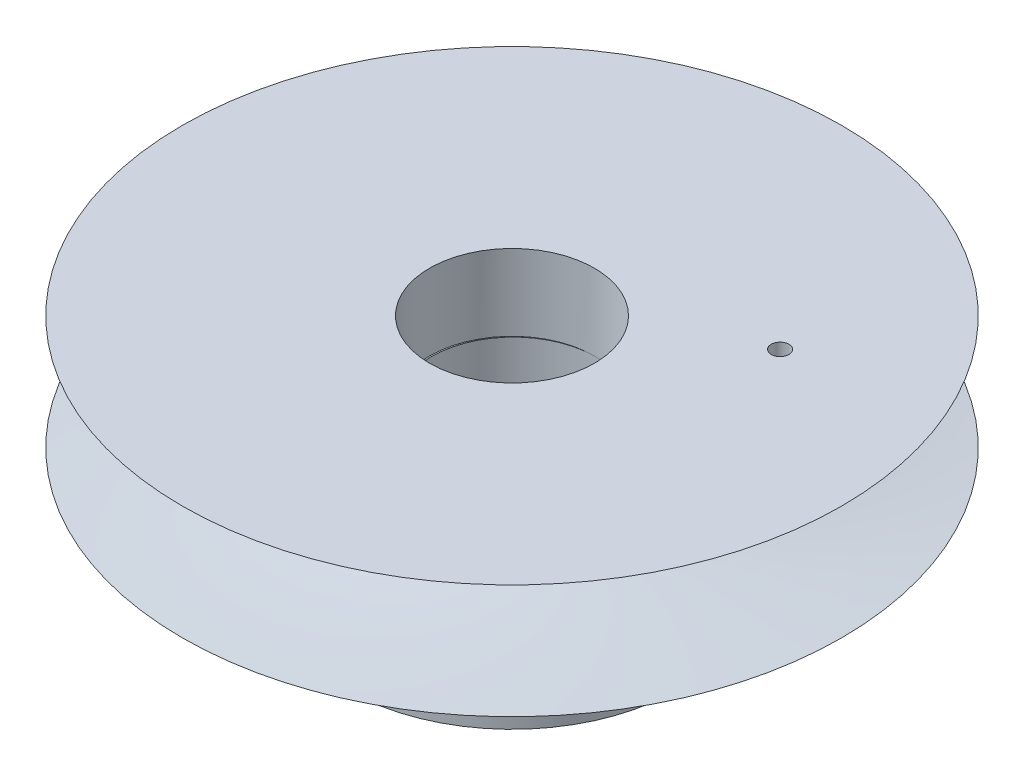
ISO-10303-21;
HEADER;
FILE_DESCRIPTION(('STEP AP214'),'2;1');
FILE_NAME('part.step','',(''),(''),'','','');
FILE_SCHEMA(('AUTOMOTIVE_DESIGN { 1 0 10303 214 1 1 1 1 }'));
ENDSEC;
DATA;
#1=APPLICATION_CONTEXT('core data for automotive mechanical design processes');
#2=APPLICATION_PROTOCOL_DEFINITION('international standard','automotive_design',2000,#1);
#3=PRODUCT_CONTEXT('',#1,'mechanical');
#4=PRODUCT('Part','Part','',(#3));
#5=PRODUCT_RELATED_PRODUCT_CATEGORY('part','',(#4));
#6=PRODUCT_DEFINITION_FORMATION('','',#4);
#7=PRODUCT_DEFINITION_CONTEXT('part definition',#1,'design');
#8=PRODUCT_DEFINITION('design','',#6,#7);
#9=PRODUCT_DEFINITION_SHAPE('','',#8);
#10=(LENGTH_UNIT() NAMED_UNIT(*) SI_UNIT(.MILLI.,.METRE.));
#11=(NAMED_UNIT(*) PLANE_ANGLE_UNIT() SI_UNIT($,.RADIAN.));
#12=(NAMED_UNIT(*) SI_UNIT($,.STERADIAN.) SOLID_ANGLE_UNIT());
#13=UNCERTAINTY_MEASURE_WITH_UNIT(LENGTH_MEASURE(1.E-05),#10,'distance_accuracy_value','');
#14=(GEOMETRIC_REPRESENTATION_CONTEXT(3) GLOBAL_UNCERTAINTY_ASSIGNED_CONTEXT((#13)) GLOBAL_UNIT_ASSIGNED_CONTEXT((#10,
#11,#12)) REPRESENTATION_CONTEXT('',''));
#15=CARTESIAN_POINT('',(0.,0.,0.));
#16=DIRECTION('',(0.,0.,1.));
#17=DIRECTION('',(1.,0.,0.));
#18=AXIS2_PLACEMENT_3D('',#15,#16,#17);
#19=CARTESIAN_POINT('',(1.81538548412725,-5.43164949076936,-0.870852952540729));
#20=DIRECTION('',(-0.991094193323921,0.,-0.133162682308544));
#21=DIRECTION('',(-0.133162682308544,0.,0.991094193323921));
#22=AXIS2_PLACEMENT_3D('',#19,#20,#21);
#23=CYLINDRICAL_SURFACE('',#22,0.799999999999998);
#24=CARTESIAN_POINT('',(11.3629547996772,-5.43164949076936,1.2191400607756));
#25=CARTESIAN_POINT('',(11.362955824008,-5.38746564802559,1.21913889182571));
#26=CARTESIAN_POINT('',(11.3643840639199,-5.34326734263764,1.21562619161921));
#27=CARTESIAN_POINT('',(11.369970894691,-5.25613884409695,1.2016793800079));
#28=CARTESIAN_POINT('',(11.3741311256032,-5.21320942886404,1.19124111104665));
#29=CARTESIAN_POINT('',(11.3848089209207,-5.12989205809428,1.16377040137494));
#30=CARTESIAN_POINT('',(11.3913234633044,-5.08950092206456,1.14674641220722));
#31=CARTESIAN_POINT('',(11.4061722618849,-5.0122643975639,1.10656738660333));
#32=CARTESIAN_POINT('',(11.4145065835889,-4.97541913680366,1.08341212945177));
#33=CARTESIAN_POINT('',(11.4325288938561,-4.90552094307044,1.03103534442441));
#34=CARTESIAN_POINT('',(11.4422401607888,-4.87255623032236,1.00170407305786));
#35=CARTESIAN_POINT('',(11.4621652187059,-4.81213111086203,0.937974165068692));
#36=CARTESIAN_POINT('',(11.4723790569402,-4.78467122292829,0.903575051378586));
#37=CARTESIAN_POINT('',(11.492737323863,-4.73566767542198,0.830029058301897));
#38=CARTESIAN_POINT('',(11.5028787807879,-4.71421218977338,0.7908224724703));
#39=CARTESIAN_POINT('',(11.5222623633533,-4.67839788278787,0.709085347735116));
#40=CARTESIAN_POINT('',(11.531504616409,-4.66403805483182,0.666555281306145));
#41=CARTESIAN_POINT('',(11.5483649250624,-4.64310098300448,0.58022501484586));
#42=CARTESIAN_POINT('',(11.5560112418189,-4.63637684628741,0.536465995181015));
#43=CARTESIAN_POINT('',(11.569541500734,-4.63044321098203,0.448175650759507));
#44=CARTESIAN_POINT('',(11.5754257001312,-4.63123261499493,0.403644439734472));
#45=CARTESIAN_POINT('',(11.5851656130302,-4.64019746461082,0.316110729919203));
#46=CARTESIAN_POINT('',(11.5890629224037,-4.64821080180553,0.273096108552672));
#47=CARTESIAN_POINT('',(11.5950675351164,-4.67113767105418,0.188818926166639));
#48=CARTESIAN_POINT('',(11.5971747492606,-4.6860515468835,0.147556452548566));
#49=CARTESIAN_POINT('',(11.5998276739148,-4.72247823140479,0.0675887516157881));
#50=CARTESIAN_POINT('',(11.6003601982022,-4.74404510432438,0.028907755749405));
#51=CARTESIAN_POINT('',(11.600185118838,-4.79312473062051,-0.0444765050439377));
#52=CARTESIAN_POINT('',(11.599477307341,-4.82063847984959,-0.0791791022645083));
#53=CARTESIAN_POINT('',(11.5972362686096,-4.88167930416778,-0.144519330407231));
#54=CARTESIAN_POINT('',(11.5956819969905,-4.91534448689723,-0.175027351129087));
#55=CARTESIAN_POINT('',(11.592251270701,-4.98728880544946,-0.229990541318215));
#56=CARTESIAN_POINT('',(11.5903748014738,-5.02556814971409,-0.25444543718688));
#57=CARTESIAN_POINT('',(11.586785904301,-5.10591898450074,-0.296639539025105));
#58=CARTESIAN_POINT('',(11.58507432067,-5.14800805233976,-0.31434542413599));
#59=CARTESIAN_POINT('',(11.5822416762154,-5.23462289785417,-0.342250437202742));
#60=CARTESIAN_POINT('',(11.5811204959108,-5.27914818049339,-0.352451084173401));
#61=CARTESIAN_POINT('',(11.5797484146886,-5.36817386306984,-0.364807571468669));
#62=CARTESIAN_POINT('',(11.5794763729141,-5.41264682750206,-0.367158939535269));
#63=CARTESIAN_POINT('',(11.5798026220255,-5.50134025625504,-0.364278093267064));
#64=CARTESIAN_POINT('',(11.5804008365899,-5.54556074237676,-0.359046543955736));
#65=CARTESIAN_POINT('',(11.5823194797323,-5.63178528209781,-0.341335725932225));
#66=CARTESIAN_POINT('',(11.5836285481024,-5.67381309169658,-0.328970275515855));
#67=CARTESIAN_POINT('',(11.5866752490524,-5.75524738030465,-0.297501166973181));
#68=CARTESIAN_POINT('',(11.5884129307249,-5.79465355838012,-0.278396736868558));
#69=CARTESIAN_POINT('',(11.5919529903819,-5.87054217262511,-0.233625406771424));
#70=CARTESIAN_POINT('',(11.5937559705032,-5.906955804007,-0.207842003081071));
#71=CARTESIAN_POINT('',(11.5969143735172,-5.97508925086132,-0.150653674383652));
#72=CARTESIAN_POINT('',(11.5982697263624,-6.00680833127129,-0.119247870731022));
#73=CARTESIAN_POINT('',(11.6000674715202,-6.065421196526,-0.0508800434021028));
#74=CARTESIAN_POINT('',(11.6004875098317,-6.09218309341535,-0.0138041627424656));
#75=CARTESIAN_POINT('',(11.5998804974145,-6.13916526549856,0.0642756884873532));
#76=CARTESIAN_POINT('',(11.5988535249484,-6.15938589440895,0.105279446503634));
#77=CARTESIAN_POINT('',(11.5950134077946,-6.19253436078745,0.189706413809033));
#78=CARTESIAN_POINT('',(11.592213757645,-6.2055159138138,0.233109102550756));
#79=CARTESIAN_POINT('',(11.5846619788343,-6.22398400963894,0.321314743919787));
#80=CARTESIAN_POINT('',(11.5799102120255,-6.2294719406713,0.36611743561554));
#81=CARTESIAN_POINT('',(11.5686333443281,-6.2327227601291,0.454589872658844));
#82=CARTESIAN_POINT('',(11.562157586142,-6.23068287753606,0.498258773875086));
#83=CARTESIAN_POINT('',(11.5476105302422,-6.21938835102713,0.584377872588568));
#84=CARTESIAN_POINT('',(11.5395392732158,-6.21013389107462,0.626828101131936));
#85=CARTESIAN_POINT('',(11.5222473655215,-6.18477333531236,0.709153215888572));
#86=CARTESIAN_POINT('',(11.5130321729211,-6.16869895324306,0.749039050552911));
#87=CARTESIAN_POINT('',(11.4939580501648,-6.13018681158355,0.825441122442783));
#88=CARTESIAN_POINT('',(11.4840990398487,-6.10774825843779,0.861956938703935));
#89=CARTESIAN_POINT('',(11.4641264905033,-6.0565235958915,0.931566330053697));
#90=CARTESIAN_POINT('',(11.4540124487805,-6.02759985371037,0.964558483191727));
#91=CARTESIAN_POINT('',(11.4344744895567,-5.964494248948,1.0253182066733));
#92=CARTESIAN_POINT('',(11.4250507467067,-5.93031106242302,1.05308445759302));
#93=CARTESIAN_POINT('',(11.4074502335692,-5.85692114948477,1.10315038380213));
#94=CARTESIAN_POINT('',(11.3992987219608,-5.81763565017607,1.12534364354321));
#95=CARTESIAN_POINT('',(11.3851405735877,-5.73561974131288,1.16298783019119));
#96=CARTESIAN_POINT('',(11.3791323324154,-5.69289193809235,1.17844380242324));
#97=CARTESIAN_POINT('',(11.3707055015352,-5.61379235935702,1.19985233005622));
#98=CARTESIAN_POINT('',(11.3678151539306,-5.5778078649709,1.20707100552066));
#99=CARTESIAN_POINT('',(11.3639394544073,-5.50510203575396,1.21671516256877));
#100=CARTESIAN_POINT('',(11.3629539481223,-5.46838076087473,1.21914103255649));
#101=CARTESIAN_POINT('',(11.3629547996772,-5.43164949076936,1.2191400607756));
#102=B_SPLINE_CURVE_WITH_KNOTS('',3,(#24,#25,#26,#27,#28,#29,#30,#31,#32,#33,#34,#35,#36,#37,
#38,#39,#40,#41,#42,#43,#44,#45,#46,#47,#48,#49,#50,#51,#52,#53,#54,#55,#56,#57,#58,#59,#60,#61,
#62,#63,#64,#65,#66,#67,#68,#69,#70,#71,#72,#73,#74,#75,#76,#77,#78,#79,#80,#81,#82,#83,#84,#85,
#86,#87,#88,#89,#90,#91,#92,#93,#94,#95,#96,#97,#98,#99,#100,#101),.UNSPECIFIED.,.T.,.F.,(4,2,2,
2,2,2,2,2,2,2,2,2,2,2,2,2,2,2,2,2,2,2,2,2,2,2,2,2,2,2,2,2,2,2,2,2,2,2,4),(0.,0.132416623177268,
0.264912810695005,0.39723952514844,0.529571003790153,0.66448950887155,0.799420722795304,
0.936240258965104,1.073040379777,1.2071616687229,1.34126336873116,1.4724286844168,
1.60360053528276,1.73586773247498,1.8681570960633,2.00389639374017,2.13964182565426,
2.2760490299111,2.41242861857493,2.54538454356824,2.67832880900398,2.80920845961829,
2.94010310791573,3.07345592241951,3.20682959497394,3.34335815620517,3.47987933347305,
3.61537353448868,3.75084263107127,3.88278793392237,4.01472987243075,4.14606487058248,
4.27741625224572,4.41187567108434,4.54636899252238,4.68326281608587,4.82005394766897,
4.9301445296165,5.04022618957013),.UNSPECIFIED.);
#103=CARTESIAN_POINT('',(11.3629547996772,-5.43164949076936,1.2191400607756));
#104=VERTEX_POINT('',#103);
#105=EDGE_CURVE('E43',#104,#104,#102,.T.);
#106=ORIENTED_EDGE('',*,*,#105,.T.);
#107=EDGE_LOOP('',(#106));
#108=FACE_BOUND('',#107,.T.);
#109=CARTESIAN_POINT('',(14.6232276632152,-5.43164949076936,1.65718790980036));
#110=CARTESIAN_POINT('',(14.6232285423907,-5.38689388208723,1.65718610338816));
#111=CARTESIAN_POINT('',(14.6241932172446,-5.34211011048688,1.65351536227793));
#112=CARTESIAN_POINT('',(14.6279879225404,-5.25378835530042,1.63892462455044));
#113=CARTESIAN_POINT('',(14.6308199146819,-5.21025173214282,1.62799700417297));
#114=CARTESIAN_POINT('',(14.6381507130368,-5.1257158485961,1.59920370558382));
#115=CARTESIAN_POINT('',(14.642648402077,-5.08471490899901,1.58134267718221));
#116=CARTESIAN_POINT('',(14.6530073040293,-5.0063739620068,1.53917613265695));
#117=CARTESIAN_POINT('',(14.6588682794177,-4.96903331849192,1.51487173904977));
#118=CARTESIAN_POINT('',(14.6716068562294,-4.89886477627407,1.46033985308055));
#119=CARTESIAN_POINT('',(14.6784891935206,-4.86605935393636,1.43008454254686));
#120=CARTESIAN_POINT('',(14.6928249730675,-4.80608656379418,1.36453726206844));
#121=CARTESIAN_POINT('',(14.7002784434357,-4.77891947376611,1.32924504412141));
#122=CARTESIAN_POINT('',(14.7153491757765,-4.73091419341167,1.2544572869117));
#123=CARTESIAN_POINT('',(14.72296688137,-4.71009629970239,1.21494880164004));
#124=CARTESIAN_POINT('',(14.7379360486431,-4.67551033759991,1.13291094451407));
#125=CARTESIAN_POINT('',(14.7452875197957,-4.66174201814593,1.09038168030203));
#126=CARTESIAN_POINT('',(14.7593425038368,-4.64171306797088,1.00371794896085));
#127=CARTESIAN_POINT('',(14.7660490831124,-4.63541510978355,0.959592607799138));
#128=CARTESIAN_POINT('',(14.7785994402972,-4.63038999645085,0.870792422805709));
#129=CARTESIAN_POINT('',(14.7844432507854,-4.63166255535966,0.826117599792069));
#130=CARTESIAN_POINT('',(14.7950849286729,-4.64171239317647,0.737740465696337));
#131=CARTESIAN_POINT('',(14.7998882190077,-4.65044952818574,0.694034233195488));
#132=CARTESIAN_POINT('',(14.8084401951434,-4.67511777493138,0.608593787501458));
#133=CARTESIAN_POINT('',(14.8121888616132,-4.69104901852023,0.566859610467281));
#134=CARTESIAN_POINT('',(14.818686810666,-4.72969609794835,0.486444010430453));
#135=CARTESIAN_POINT('',(14.8214334868195,-4.75242935216511,0.44777075117003));
#136=CARTESIAN_POINT('',(14.8260382059198,-4.8040224711038,0.374693012350333));
#137=CARTESIAN_POINT('',(14.8278962098182,-4.83288260496094,0.340288720419042));
#138=CARTESIAN_POINT('',(14.830908169946,-4.89613519918013,0.276519536058027));
#139=CARTESIAN_POINT('',(14.8320574378078,-4.93056263788654,0.247189106186187));
#140=CARTESIAN_POINT('',(14.8338320988496,-5.00385228459629,0.194701435202917));
#141=CARTESIAN_POINT('',(14.8344574905101,-5.04271450546203,0.171544211996561));
#142=CARTESIAN_POINT('',(14.835374044976,-5.12380105148705,0.132086417340071));
#143=CARTESIAN_POINT('',(14.8356650753751,-5.16602670148361,0.115788563802393));
#144=CARTESIAN_POINT('',(14.8360633118534,-5.25262571324516,0.0905641895641914));
#145=CARTESIAN_POINT('',(14.8361705264048,-5.29699897592803,0.0816373291385821));
#146=CARTESIAN_POINT('',(14.8362896290041,-5.38632666118881,0.0714669594083169));
#147=CARTESIAN_POINT('',(14.8363021284823,-5.43127547653657,0.0701741805181361));
#148=CARTESIAN_POINT('',(14.8362464508406,-5.52074740301057,0.0751805424654309));
#149=CARTESIAN_POINT('',(14.8361782753658,-5.56527052279879,0.0814795284940992));
#150=CARTESIAN_POINT('',(14.8358988536232,-5.65248110194662,0.10144044943636));
#151=CARTESIAN_POINT('',(14.8356880686569,-5.69517400949202,0.115078615158611));
#152=CARTESIAN_POINT('',(14.8349962093295,-5.77768258333974,0.149288353446227));
#153=CARTESIAN_POINT('',(14.8345151258527,-5.81749815255307,0.169860159838414));
#154=CARTESIAN_POINT('',(14.8331054192907,-5.89334332008084,0.217449179952169));
#155=CARTESIAN_POINT('',(14.8321745429946,-5.9293527327057,0.244498494502588));
#156=CARTESIAN_POINT('',(14.8296675182739,-5.99635760013778,0.304198701990065));
#157=CARTESIAN_POINT('',(14.8280913458281,-6.02735286823351,0.336849803427388));
#158=CARTESIAN_POINT('',(14.8240954174176,-6.08362105686695,0.407009497784259));
#159=CARTESIAN_POINT('',(14.8216711099469,-6.10886186416613,0.444543598526803));
#160=CARTESIAN_POINT('',(14.8158312504636,-6.15268257787918,0.523247496623109));
#161=CARTESIAN_POINT('',(14.8124157177072,-6.17126261367381,0.564417223338058));
#162=CARTESIAN_POINT('',(14.804524556844,-6.20118117293371,0.649093133566165));
#163=CARTESIAN_POINT('',(14.8000517012225,-6.21253835331013,0.692592980196058));
#164=CARTESIAN_POINT('',(14.7900553801637,-6.22774953022037,0.780767484098668));
#165=CARTESIAN_POINT('',(14.7845319600101,-6.2316038500773,0.825442090662999));
#166=CARTESIAN_POINT('',(14.7725932641062,-6.23169403092554,0.914381634596473));
#167=CARTESIAN_POINT('',(14.7661840440878,-6.22797944776823,0.958647342789999));
#168=CARTESIAN_POINT('',(14.7526669105414,-6.21314210098296,1.04580857745071));
#169=CARTESIAN_POINT('',(14.7455589973586,-6.20201934101534,1.08870410459488));
#170=CARTESIAN_POINT('',(14.7309572839263,-6.17269672960967,1.17191640578135));
#171=CARTESIAN_POINT('',(14.723463608032,-6.15449914658373,1.21223400156988));
#172=CARTESIAN_POINT('',(14.7084659455005,-6.11154858667805,1.2892078841463));
#173=CARTESIAN_POINT('',(14.7009619587625,-6.08679554525455,1.32586413488042));
#174=CARTESIAN_POINT('',(14.6863141325435,-6.03125302080083,1.39475152648839));
#175=CARTESIAN_POINT('',(14.6791728472817,-6.00042664862577,1.4269534691128));
#176=CARTESIAN_POINT('',(14.6657308394642,-5.9336888633646,1.48580002728916));
#177=CARTESIAN_POINT('',(14.6594303166723,-5.89777624595848,1.51244332296023));
#178=CARTESIAN_POINT('',(14.6480534605966,-5.82173354753015,1.55953020684399));
#179=CARTESIAN_POINT('',(14.6429817445171,-5.78158834903103,1.57995048409934));
#180=CARTESIAN_POINT('',(14.6344397952977,-5.69835031402823,1.61387478872132));
#181=CARTESIAN_POINT('',(14.6309678131482,-5.65526075612353,1.62738637123598));
#182=CARTESIAN_POINT('',(14.626702664487,-5.58189625962208,1.64387832601437));
#183=CARTESIAN_POINT('',(14.6254035894691,-5.55208487697699,1.64886257883413));
#184=CARTESIAN_POINT('',(14.6236657951211,-5.49206977036485,1.65551796868654));
#185=CARTESIAN_POINT('',(14.6232270696436,-5.46186604920267,1.65718912939186));
#186=CARTESIAN_POINT('',(14.6232276632152,-5.43164949076936,1.65718790980036));
#187=B_SPLINE_CURVE_WITH_KNOTS('',3,(#109,#110,#111,#112,#113,#114,#115,#116,#117,#118,#119,
#120,#121,#122,#123,#124,#125,#126,#127,#128,#129,#130,#131,#132,#133,#134,#135,#136,#137,#138,
#139,#140,#141,#142,#143,#144,#145,#146,#147,#148,#149,#150,#151,#152,#153,#154,#155,#156,#157,
#158,#159,#160,#161,#162,#163,#164,#165,#166,#167,#168,#169,#170,#171,#172,#173,#174,#175,#176,
#177,#178,#179,#180,#181,#182,#183,#184,#185,#186),.UNSPECIFIED.,.T.,.F.,(4,2,2,2,2,2,2,2,2,2,2,
2,2,2,2,2,2,2,2,2,2,2,2,2,2,2,2,2,2,2,2,2,2,2,2,2,2,2,4),(0.,0.134156444816222,
0.268454051962342,0.402661749135058,0.536846080960288,0.671673254094057,0.806507068006988,
0.941767496346315,1.07702310723883,1.21159999492362,1.34617179953998,1.48002441067543,
1.6138794751396,1.74808028857725,1.8822869982689,2.01737223537042,2.15245786427561,
2.28759696836332,2.42272984361512,2.55698962354853,2.69124666574639,2.82507148757523,
2.95890082290074,3.09340763033806,3.22791944524748,3.36316447844813,3.49840688446776,
3.63329851994902,3.76818434237438,3.90218986536058,4.0361953221355,4.17015784790922,
4.3041216927006,4.43892581295428,4.57376190562698,4.70909704556757,4.84428386868606,
4.93485966775244,5.02543481963532),.UNSPECIFIED.);
#188=CARTESIAN_POINT('',(14.6232276632152,-5.43164949076936,1.65718790980036));
#189=VERTEX_POINT('',#188);
#190=EDGE_CURVE('E103',#189,#189,#187,.T.);
#191=ORIENTED_EDGE('',*,*,#190,.F.);
#192=EDGE_LOOP('',(#191));
#193=FACE_BOUND('',#192,.T.);
#194=ADVANCED_FACE('F37',(#108,#193),#23,.F.);
#195=CARTESIAN_POINT('',(-4.7030891410279,1.56463653790778,0.));
#196=CARTESIAN_POINT('',(8.2969108589721,-1.43536346209222,0.));
#197=CARTESIAN_POINT('',(-4.7030891410279,-2.93536346209222,0.));
#198=B_SPLINE_CURVE_WITH_KNOTS('',2,(#195,#196,#197),.UNSPECIFIED.,.F.,.F.,(3,3),(0.,1.),.UNSPECIFIED.);
#199=CARTESIAN_POINT('',(8.2969108589721,-2.93536346209222,0.));
#200=DIRECTION('',(0.,-1.,0.));
#201=AXIS1_PLACEMENT('',#199,#200);
#202=SURFACE_OF_REVOLUTION('',#198,#201);
#203=CARTESIAN_POINT('',(14.7306842350758,-0.137545685161674,-3.78665927067086));
#204=CARTESIAN_POINT('',(14.7524880423904,-0.128022776899245,-3.78665945360138));
#205=CARTESIAN_POINT('',(14.774142958328,-0.118153199409983,-3.78869845889688));
#206=CARTESIAN_POINT('',(14.816601616338,-0.0980627513688897,-3.79667980399076));
#207=CARTESIAN_POINT('',(14.8374033799984,-0.0878411554093741,-3.80263072545225));
#208=CARTESIAN_POINT('',(14.8775063595165,-0.067397353666468,-3.81821802500021));
#209=CARTESIAN_POINT('',(14.8968110687977,-0.0571752086468087,-3.8278454920844));
#210=CARTESIAN_POINT('',(14.9334516556567,-0.0369658054808928,-3.85056378734687));
#211=CARTESIAN_POINT('',(14.9507846650859,-0.0269789058545795,-3.8636595709227));
#212=CARTESIAN_POINT('',(14.9829633859423,-0.00746905334614902,-3.89307641023971));
#213=CARTESIAN_POINT('',(14.9977968004458,0.00205145123808069,-3.90941259712734));
#214=CARTESIAN_POINT('',(15.0242850530844,0.0203111866631368,-3.94485880790843));
#215=CARTESIAN_POINT('',(15.0359418954949,0.0290509077924598,-3.96396707102678));
#216=CARTESIAN_POINT('',(15.054999301863,0.0450545932673463,-4.0033455946064));
#217=CARTESIAN_POINT('',(15.0625930984939,0.05237229438464,-4.02350017781848));
#218=CARTESIAN_POINT('',(15.0739863227207,0.0658419780057974,-4.06518311011768));
#219=CARTESIAN_POINT('',(15.0777945165633,0.0719966268495735,-4.08670816195498));
#220=CARTESIAN_POINT('',(15.0811716802236,0.0824992358114472,-4.12863985472954));
#221=CARTESIAN_POINT('',(15.0810620153768,0.0869538181606614,-4.14899390031347));
#222=CARTESIAN_POINT('',(15.0772555669366,0.0945742941696207,-4.18960814368091));
#223=CARTESIAN_POINT('',(15.073560679129,0.0977408676438877,-4.2098683853771));
#224=CARTESIAN_POINT('',(15.0630195228015,0.102490049271375,-4.24808885242244));
#225=CARTESIAN_POINT('',(15.0564301484846,0.104173570078617,-4.26610766353498));
#226=CARTESIAN_POINT('',(15.0403571179217,0.106290322580797,-4.30088238401837));
#227=CARTESIAN_POINT('',(15.0308743230058,0.106723925957555,-4.31763866737723));
#228=CARTESIAN_POINT('',(15.0097568003996,0.106335772973921,-4.34868803424499));
#229=CARTESIAN_POINT('',(14.9982297222422,0.105566200233738,-4.36305520698049));
#230=CARTESIAN_POINT('',(14.9731136565103,0.102889667586205,-4.38976890583614));
#231=CARTESIAN_POINT('',(14.9595219625367,0.100981205006542,-4.40211273484241));
#232=CARTESIAN_POINT('',(14.930706593256,0.0960815880337972,-4.42444989994798));
#233=CARTESIAN_POINT('',(14.9154830009916,0.0930904887147387,-4.43444335556876));
#234=CARTESIAN_POINT('',(14.8838328782062,0.0861030094763409,-4.45189357851671));
#235=CARTESIAN_POINT('',(14.867404568006,0.082105120165258,-4.45934649719818));
#236=CARTESIAN_POINT('',(14.8331631661637,0.0730326218470007,-4.47183540432064));
#237=CARTESIAN_POINT('',(14.8153210384709,0.0679219721490656,-4.47676528864877));
#238=CARTESIAN_POINT('',(14.7793170399134,0.0568451682841831,-4.48374988625452));
#239=CARTESIAN_POINT('',(14.7611546923653,0.0508776238948765,-4.48579986774959));
#240=CARTESIAN_POINT('',(14.7237726655056,0.0378013486522078,-4.48712315649504));
#241=CARTESIAN_POINT('',(14.7045635424498,0.0306429797857098,-4.48620152006191));
#242=CARTESIAN_POINT('',(14.6667774230858,0.015663247122014,-4.48130363186169));
#243=CARTESIAN_POINT('',(14.6482015123378,0.00784081783585622,-4.47732238526506));
#244=CARTESIAN_POINT('',(14.6107190832189,-0.00892562069059466,-4.46608345856086));
#245=CARTESIAN_POINT('',(14.5918996911812,-0.0179095254228833,-4.4585945441988));
#246=CARTESIAN_POINT('',(14.555960040902,-0.0362448437252807,-4.44059320993032));
#247=CARTESIAN_POINT('',(14.5388405391772,-0.0455964183611732,-4.43007945189225));
#248=CARTESIAN_POINT('',(14.5056275306196,-0.0650817284906285,-4.40555198500114));
#249=CARTESIAN_POINT('',(14.4896771703984,-0.0752262325171255,-4.39135252699894));
#250=CARTESIAN_POINT('',(14.4606031850977,-0.0954047144767724,-4.36028488229922));
#251=CARTESIAN_POINT('',(14.4474758661298,-0.105438820339455,-4.34342023372563));
#252=CARTESIAN_POINT('',(14.4241600525154,-0.125325819386845,-4.30701333336033));
#253=CARTESIAN_POINT('',(14.4140435972642,-0.13516968603367,-4.28741977100869));
#254=CARTESIAN_POINT('',(14.3975743117474,-0.154057646321508,-4.24632958316782));
#255=CARTESIAN_POINT('',(14.3912227693818,-0.163101465383559,-4.22483230934481));
#256=CARTESIAN_POINT('',(14.3829321895648,-0.179489426062024,-4.18167378806571));
#257=CARTESIAN_POINT('',(14.3807834450021,-0.186896973098744,-4.16007756499537));
#258=CARTESIAN_POINT('',(14.3805922522073,-0.200095000640093,-4.11642364206315));
#259=CARTESIAN_POINT('',(14.3825368588667,-0.205890513525954,-4.09436761475594));
#260=CARTESIAN_POINT('',(14.3902026472433,-0.214841299869574,-4.05326322854409));
#261=CARTESIAN_POINT('',(14.3954355900969,-0.218232004080802,-4.03417541045908));
#262=CARTESIAN_POINT('',(14.4091623258138,-0.223159893583507,-3.99696047002838));
#263=CARTESIAN_POINT('',(14.4176528834197,-0.224698911600939,-3.97883241476944));
#264=CARTESIAN_POINT('',(14.4364516825691,-0.22572935936375,-3.94629661525805));
#265=CARTESIAN_POINT('',(14.4464274096688,-0.225440889369434,-3.93170226095469));
#266=CARTESIAN_POINT('',(14.4683970818668,-0.223344781723078,-3.90424952408124));
#267=CARTESIAN_POINT('',(14.4803906422862,-0.221537433367459,-3.89139081146972));
#268=CARTESIAN_POINT('',(14.505673025951,-0.216588549382753,-3.86803520792961));
#269=CARTESIAN_POINT('',(14.5189213851142,-0.213481938279158,-3.85748677837716));
#270=CARTESIAN_POINT('',(14.5465926997834,-0.206109379693282,-3.83851096204489));
#271=CARTESIAN_POINT('',(14.5610177453326,-0.201841336421151,-3.83008746314522));
#272=CARTESIAN_POINT('',(14.5917559900457,-0.191995565061495,-3.81492318904724));
#273=CARTESIAN_POINT('',(14.6081298431227,-0.186344082261825,-3.80835397169554));
#274=CARTESIAN_POINT('',(14.6413854240389,-0.174181767580859,-3.79779276205735));
#275=CARTESIAN_POINT('',(14.6582675088997,-0.167670320178973,-3.7938026279244));
#276=CARTESIAN_POINT('',(14.6936874505278,-0.153409562665431,-3.78811803570263));
#277=CARTESIAN_POINT('',(14.7122391195415,-0.145601670090804,-3.78665911591924));
#278=CARTESIAN_POINT('',(14.7306842350758,-0.137545685161674,-3.78665927067086));
#279=B_SPLINE_CURVE_WITH_KNOTS('',3,(#203,#204,#205,#206,#207,#208,#209,#210,#211,#212,#213,
#214,#215,#216,#217,#218,#219,#220,#221,#222,#223,#224,#225,#226,#227,#228,#229,#230,#231,#232,
#233,#234,#235,#236,#237,#238,#239,#240,#241,#242,#243,#244,#245,#246,#247,#248,#249,#250,#251,
#252,#253,#254,#255,#256,#257,#258,#259,#260,#261,#262,#263,#264,#265,#266,#267,#268,#269,#270,
#271,#272,#273,#274,#275,#276,#277,#278),.UNSPECIFIED.,.T.,.F.,(4,2,2,2,2,2,2,2,2,2,2,2,2,2,2,2,
2,2,2,2,2,2,2,2,2,2,2,2,2,2,2,2,2,2,2,2,2,4),(0.,0.0713004931160844,0.142757924140133,
0.214043248797715,0.285430977851879,0.357160252586596,0.428844164001542,0.496719473625083,
0.564437236992337,0.626614220095326,0.688758343303469,0.746245734294942,0.803716028778376,
0.8587620379554,0.913880836935417,0.968996832401267,1.02419595554297,1.08155719200694,
1.13901256522873,1.20031187728055,1.26171147391418,1.32789779617974,1.39411344311889,
1.46471659794997,1.53522680027131,1.60730889049318,1.67941562431854,1.74782211503298,
1.81601259720353,1.87590705232985,1.93574217739143,1.98851980792099,2.04128738832381,
2.09271947806983,2.14424499896095,2.19959938637953,2.25499361068226,2.31531086693987),.UNSPECIFIED.);
#280=CARTESIAN_POINT('',(14.7306842350758,-0.137545685161674,-3.78665927067086));
#281=VERTEX_POINT('',#280);
#282=EDGE_CURVE('E67',#281,#281,#279,.T.);
#283=ORIENTED_EDGE('',*,*,#282,.T.);
#284=EDGE_LOOP('',(#283));
#285=FACE_BOUND('',#284,.T.);
#286=CARTESIAN_POINT('',(8.2969108589721,-2.93536346209222,0.));
#287=DIRECTION('',(0.,-1.,0.));
#288=DIRECTION('',(0.,0.,-1.));
#289=AXIS2_PLACEMENT_3D('',#286,#287,#288);
#290=CIRCLE('',#289,13.);
#291=CARTESIAN_POINT('',(8.2969108589721,-2.93536346209222,-13.));
#292=VERTEX_POINT('',#291);
#293=EDGE_CURVE('E84',#292,#292,#290,.T.);
#294=ORIENTED_EDGE('',*,*,#293,.F.);
#295=EDGE_LOOP('',(#294));
#296=FACE_BOUND('',#295,.T.);
#297=CARTESIAN_POINT('',(8.2969108589721,1.56463653790778,0.));
#298=DIRECTION('',(0.,-1.,0.));
#299=DIRECTION('',(0.,0.,-1.));
#300=AXIS2_PLACEMENT_3D('',#297,#298,#299);
#301=CIRCLE('',#300,13.);
#302=CARTESIAN_POINT('',(8.2969108589721,1.56463653790778,-13.));
#303=VERTEX_POINT('',#302);
#304=EDGE_CURVE('E82',#303,#303,#301,.T.);
#305=ORIENTED_EDGE('',*,*,#304,.T.);
#306=EDGE_LOOP('',(#305));
#307=FACE_BOUND('',#306,.T.);
#308=ADVANCED_FACE('F39',(#285,#296,#307),#202,.T.);
#309=CARTESIAN_POINT('',(-4.7030891410279,-2.93536346209222,0.));
#310=DIRECTION('',(0.,1.,0.));
#311=DIRECTION('',(0.,0.,1.));
#312=AXIS2_PLACEMENT_3D('',#309,#310,#311);
#313=PLANE('',#312);
#314=CARTESIAN_POINT('',(8.29691086,-2.93536346209222,0.));
#315=DIRECTION('',(0.,-1.,0.));
#316=DIRECTION('',(0.,0.,-1.));
#317=AXIS2_PLACEMENT_3D('',#314,#315,#316);
#318=CIRCLE('',#317,6.53976727896577);
#319=CARTESIAN_POINT('',(8.29691086,-2.93536346209222,-6.53976727896577));
#320=VERTEX_POINT('',#319);
#321=EDGE_CURVE('E52',#320,#320,#318,.T.);
#322=ORIENTED_EDGE('',*,*,#321,.F.);
#323=EDGE_LOOP('',(#322));
#324=FACE_BOUND('',#323,.T.);
#325=ORIENTED_EDGE('',*,*,#293,.T.);
#326=EDGE_LOOP('',(#325));
#327=FACE_BOUND('',#326,.T.);
#328=ADVANCED_FACE('F144',(#324,#327),#313,.F.);
#329=CARTESIAN_POINT('',(-4.7030891410279,1.56463653790778,0.));
#330=DIRECTION('',(0.,1.,0.));
#331=DIRECTION('',(0.,0.,1.));
#332=AXIS2_PLACEMENT_3D('',#329,#330,#331);
#333=PLANE('',#332);
#334=CARTESIAN_POINT('',(14.7306842350758,1.56463653790778,-4.13665927067086));
#335=DIRECTION('',(0.,1.,0.));
#336=DIRECTION('',(0.,0.,1.));
#337=AXIS2_PLACEMENT_3D('',#334,#335,#336);
#338=CIRCLE('',#337,0.349999999999999);
#339=CARTESIAN_POINT('',(14.7306842350758,1.56463653790778,-3.78665927067086));
#340=VERTEX_POINT('',#339);
#341=EDGE_CURVE('E258',#340,#340,#338,.T.);
#342=ORIENTED_EDGE('',*,*,#341,.F.);
#343=EDGE_LOOP('',(#342));
#344=FACE_BOUND('',#343,.T.);
#345=CARTESIAN_POINT('',(8.29691086,1.56463653790778,0.));
#346=DIRECTION('',(0.,1.,0.));
#347=DIRECTION('',(0.,0.,1.));
#348=AXIS2_PLACEMENT_3D('',#345,#346,#347);
#349=CIRCLE('',#348,3.25);
#350=CARTESIAN_POINT('',(8.29691086,1.56463653790778,3.25));
#351=VERTEX_POINT('',#350);
#352=EDGE_CURVE('E78',#351,#351,#349,.T.);
#353=ORIENTED_EDGE('',*,*,#352,.F.);
#354=EDGE_LOOP('',(#353));
#355=FACE_BOUND('',#354,.T.);
#356=ORIENTED_EDGE('',*,*,#304,.F.);
#357=EDGE_LOOP('',(#356));
#358=FACE_BOUND('',#357,.T.);
#359=ADVANCED_FACE('F147',(#344,#355,#358),#333,.T.);
#360=CARTESIAN_POINT('',(8.29691086,-1.43536346209222,0.));
#361=DIRECTION('',(0.,1.,0.));
#362=DIRECTION('',(0.,0.,1.));
#363=AXIS2_PLACEMENT_3D('',#360,#361,#362);
#364=CYLINDRICAL_SURFACE('',#363,3.25);
#365=CARTESIAN_POINT('',(8.29691086,-1.43536346209222,0.));
#366=DIRECTION('',(0.,1.,0.));
#367=DIRECTION('',(0.,0.,1.));
#368=AXIS2_PLACEMENT_3D('',#365,#366,#367);
#369=CIRCLE('',#368,3.25);
#370=CARTESIAN_POINT('',(8.32359642051522,-1.43536346209222,3.2498904413626));
#371=VERTEX_POINT('',#370);
#372=CARTESIAN_POINT('',(8.32359642051522,-1.43536346209222,-3.2498904413626));
#373=VERTEX_POINT('',#372);
#374=EDGE_CURVE('E64',#371,#373,#369,.T.);
#375=ORIENTED_EDGE('',*,*,#374,.F.);
#376=EDGE_CURVE('E75',#373,#371,#369,.T.);
#377=ORIENTED_EDGE('',*,*,#376,.F.);
#378=EDGE_LOOP('',(#375,#377));
#379=FACE_BOUND('',#378,.T.);
#380=ORIENTED_EDGE('',*,*,#352,.T.);
#381=EDGE_LOOP('',(#380));
#382=FACE_BOUND('',#381,.T.);
#383=ADVANCED_FACE('F80',(#379,#382),#364,.F.);
#384=CARTESIAN_POINT('',(8.29691086,-1.43536346209222,0.));
#385=DIRECTION('',(0.,1.,0.));
#386=DIRECTION('',(0.,0.,1.));
#387=AXIS2_PLACEMENT_3D('',#384,#385,#386);
#388=PLANE('',#387);
#389=CARTESIAN_POINT('',(8.35028198103061,-1.43536346209222,0.));
#390=DIRECTION('',(0.,1.,0.));
#391=DIRECTION('',(0.,0.,1.));
#392=AXIS2_PLACEMENT_3D('',#389,#390,#391);
#393=CIRCLE('',#392,3.25);
#394=EDGE_CURVE('E66',#373,#371,#393,.T.);
#395=ORIENTED_EDGE('',*,*,#394,.F.);
#396=ORIENTED_EDGE('',*,*,#376,.T.);
#397=EDGE_LOOP('',(#395,#396));
#398=FACE_BOUND('',#397,.T.);
#399=ADVANCED_FACE('F76',(#398),#388,.T.);
#400=CARTESIAN_POINT('',(8.29691086,-7.93536346209222,0.));
#401=DIRECTION('',(0.,1.,0.));
#402=DIRECTION('',(0.,0.,1.));
#403=AXIS2_PLACEMENT_3D('',#400,#401,#402);
#404=CYLINDRICAL_SURFACE('',#403,6.53976727896577);
#405=ORIENTED_EDGE('',*,*,#190,.T.);
#406=EDGE_LOOP('',(#405));
#407=FACE_BOUND('',#406,.T.);
#408=CARTESIAN_POINT('',(1.75753376509114,-5.43164949076936,-0.0714372004820922));
#409=CARTESIAN_POINT('',(1.75753339390409,-5.47640509945149,-0.0714391748920874));
#410=CARTESIAN_POINT('',(1.7575718359038,-5.52118887105184,-0.0752343639631053));
#411=CARTESIAN_POINT('',(1.75776298493084,-5.6095106262383,-0.090309272843873));
#412=CARTESIAN_POINT('',(1.75791581214776,-5.6530472493959,-0.101596863837775));
#413=CARTESIAN_POINT('',(1.75844509020798,-5.73758313294262,-0.131304009659915));
#414=CARTESIAN_POINT('',(1.75882139127056,-5.77858407253971,-0.149718784699975));
#415=CARTESIAN_POINT('',(1.75995987158675,-5.85692501953192,-0.193124178252256));
#416=CARTESIAN_POINT('',(1.76072198364819,-5.8942656630468,-0.218113651362388));
#417=CARTESIAN_POINT('',(1.76282905875174,-5.96443420526465,-0.274073978032768));
#418=CARTESIAN_POINT('',(1.76417679658596,-5.99723962760236,-0.305072913253345));
#419=CARTESIAN_POINT('',(1.76765086529169,-6.05721241774454,-0.372079565161665));
#420=CARTESIAN_POINT('',(1.76977723450876,-6.08437950777261,-0.408087528476787));
#421=CARTESIAN_POINT('',(1.77498147160936,-6.13238478812706,-0.484200940684797));
#422=CARTESIAN_POINT('',(1.77806232874947,-6.15320268183633,-0.524318993556941));
#423=CARTESIAN_POINT('',(1.78527821836391,-6.18778864393881,-0.607398575330946));
#424=CARTESIAN_POINT('',(1.78941321328874,-6.20155696339279,-0.650360002908436));
#425=CARTESIAN_POINT('',(1.79873188078588,-6.22158591356784,-0.737660102235137));
#426=CARTESIAN_POINT('',(1.80391018688819,-6.22788387175517,-0.781990781049342));
#427=CARTESIAN_POINT('',(1.81524404471924,-6.23290898508787,-0.870954413995605));
#428=CARTESIAN_POINT('',(1.8213995595293,-6.23163642617906,-0.915587356647258));
#429=CARTESIAN_POINT('',(1.83446274033532,-6.22158658836225,-1.00363913940301));
#430=CARTESIAN_POINT('',(1.84136621079027,-6.21284945335298,-1.04706319325725));
#431=CARTESIAN_POINT('',(1.85566983366377,-6.18818120660734,-1.13173085195236));
#432=CARTESIAN_POINT('',(1.86306999518348,-6.17224996301849,-1.1729744168141));
#433=CARTESIAN_POINT('',(1.87802847418032,-6.13360288359037,-1.25225326630926));
#434=CARTESIAN_POINT('',(1.88558715080243,-6.11086962937361,-1.29027998874807));
#435=CARTESIAN_POINT('',(1.90043486279376,-6.05927651043492,-1.36198148662375));
#436=CARTESIAN_POINT('',(1.9077238863014,-6.03041637657778,-1.39565607077983));
#437=CARTESIAN_POINT('',(1.92165084496759,-5.9671637823586,-1.4579587240154));
#438=CARTESIAN_POINT('',(1.92828420570907,-5.93273634365218,-1.48655231522669));
#439=CARTESIAN_POINT('',(1.94042678795012,-5.85944669694243,-1.53764695999089));
#440=CARTESIAN_POINT('',(1.94593600618917,-5.8205844760767,-1.56014799587266));
#441=CARTESIAN_POINT('',(1.95546698084669,-5.73949793005167,-1.59844836340772));
#442=CARTESIAN_POINT('',(1.95948814757316,-5.69727228005511,-1.61424503858912));
#443=CARTESIAN_POINT('',(1.96576209682292,-5.61067326829357,-1.63867995640795));
#444=CARTESIAN_POINT('',(1.96801496084608,-5.5663000056107,-1.64731852895852));
#445=CARTESIAN_POINT('',(1.97058458708726,-5.47697232034991,-1.65715964814589));
#446=CARTESIAN_POINT('',(1.97091376443987,-5.43202350500215,-1.65840987843123));
#447=CARTESIAN_POINT('',(1.96964602062585,-5.34255157852815,-1.6535663687978));
#448=CARTESIAN_POINT('',(1.96804913873479,-5.29802845873993,-1.64747277863184));
#449=CARTESIAN_POINT('',(1.96304989550388,-5.2108178795921,-1.62814600941162));
#450=CARTESIAN_POINT('',(1.95965336318417,-5.1681249720467,-1.614935878346));
#451=CARTESIAN_POINT('',(1.95129090507569,-5.08561639819898,-1.58175675603362));
#452=CARTESIAN_POINT('',(1.94632492635999,-5.04580082898565,-1.56178753684647));
#453=CARTESIAN_POINT('',(1.93512334875583,-4.96995566145788,-1.515514145279));
#454=CARTESIAN_POINT('',(1.92888145004226,-4.93394624883302,-1.48917841576992));
#455=CARTESIAN_POINT('',(1.9155414840795,-4.86694138140094,-1.43093371425029));
#456=CARTESIAN_POINT('',(1.9084433849652,-4.83594611330521,-1.39902453479339));
#457=CARTESIAN_POINT('',(1.89377870091691,-4.77967792467177,-1.33029828654808));
#458=CARTESIAN_POINT('',(1.8862097731917,-4.75443711737259,-1.29345541317541));
#459=CARTESIAN_POINT('',(1.87106835326513,-4.71061640365954,-1.21600126585621));
#460=CARTESIAN_POINT('',(1.86349586113587,-4.69203636786491,-1.17539006512604));
#461=CARTESIAN_POINT('',(1.84875666036845,-4.66211780860501,-1.09163425247125));
#462=CARTESIAN_POINT('',(1.84158895021275,-4.6507606282286,-1.04849648450211));
#463=CARTESIAN_POINT('',(1.82795678485292,-4.63554945131835,-0.96081048994891));
#464=CARTESIAN_POINT('',(1.82149229935585,-4.63169513146142,-0.916262324227641));
#465=CARTESIAN_POINT('',(1.80953168828338,-4.63160495061318,-0.827325724800008));
#466=CARTESIAN_POINT('',(1.80402951827851,-4.63531953377049,-0.782938146037969));
#467=CARTESIAN_POINT('',(1.79406075718562,-4.65015688055576,-0.695300154680545));
#468=CARTESIAN_POINT('',(1.78959416558592,-4.66127964052338,-0.652049741523305));
#469=CARTESIAN_POINT('',(1.78171385508749,-4.69060225192905,-0.567934357613135));
#470=CARTESIAN_POINT('',(1.77829979934093,-4.70879983495499,-0.527068627080866));
#471=CARTESIAN_POINT('',(1.77244804833165,-4.75175039486067,-0.448865906601185));
#472=CARTESIAN_POINT('',(1.77001036268266,-4.77650343628417,-0.41152895140231));
#473=CARTESIAN_POINT('',(1.76595563994075,-4.83204596073789,-0.341218278251094));
#474=CARTESIAN_POINT('',(1.76434384619378,-4.86287233291295,-0.308273397239116));
#475=CARTESIAN_POINT('',(1.76177638226976,-4.92961011817412,-0.24796574339345));
#476=CARTESIAN_POINT('',(1.76082086780073,-4.96552273558024,-0.220604296359939));
#477=CARTESIAN_POINT('',(1.75936549936706,-5.04156543400857,-0.172184368739466));
#478=CARTESIAN_POINT('',(1.75886734495484,-5.08171063250768,-0.151149591123377));
#479=CARTESIAN_POINT('',(1.75815191766239,-5.16494866751048,-0.116173720807695));
#480=CARTESIAN_POINT('',(1.75793433755607,-5.20803822541519,-0.102224879243078));
#481=CARTESIAN_POINT('',(1.7576951148712,-5.28140272191664,-0.0851920040300962));
#482=CARTESIAN_POINT('',(1.75763250762501,-5.31121410456173,-0.0800416203156364));
#483=CARTESIAN_POINT('',(1.75755195819723,-5.37122921117388,-0.0731635642622601));
#484=CARTESIAN_POINT('',(1.7575340156965,-5.40143293233605,-0.0714358674675998));
#485=CARTESIAN_POINT('',(1.75753376509114,-5.43164949076936,-0.0714372004820922));
#486=B_SPLINE_CURVE_WITH_KNOTS('',3,(#408,#409,#410,#411,#412,#413,#414,#415,#416,#417,#418,
#419,#420,#421,#422,#423,#424,#425,#426,#427,#428,#429,#430,#431,#432,#433,#434,#435,#436,#437,
#438,#439,#440,#441,#442,#443,#444,#445,#446,#447,#448,#449,#450,#451,#452,#453,#454,#455,#456,
#457,#458,#459,#460,#461,#462,#463,#464,#465,#466,#467,#468,#469,#470,#471,#472,#473,#474,#475,
#476,#477,#478,#479,#480,#481,#482,#483,#484,#485),.UNSPECIFIED.,.T.,.F.,(4,2,2,2,2,2,2,2,2,2,2,
2,2,2,2,2,2,2,2,2,2,2,2,2,2,2,2,2,2,2,2,2,2,2,2,2,2,2,4),(0.,0.134156444816222,
0.268454051962342,0.402661749135058,0.536846080960288,0.671673254094056,0.806507068006987,
0.941767496346315,1.07702310723883,1.21159999492362,1.34617179953998,1.48002441067543,
1.6138794751396,1.74808028857725,1.8822869982689,2.01737223537042,2.15245786427561,
2.28759696836332,2.42272984361512,2.55698962354853,2.69124666574639,2.82507148757523,
2.95890082290074,3.09340763033806,3.22791944524748,3.36316447844813,3.49840688446776,
3.63329851994902,3.76818434237438,3.90218986536058,4.0361953221355,4.17015784790922,
4.30412169270059,4.43892581295428,4.57376190562698,4.70909704556756,4.84428386868606,
4.93485966775244,5.02543481963532),.UNSPECIFIED.);
#487=CARTESIAN_POINT('',(1.75753376509114,-5.43164949076936,-0.0714372004820922));
#488=VERTEX_POINT('',#487);
#489=EDGE_CURVE('E11',#488,#488,#486,.T.);
#490=ORIENTED_EDGE('',*,*,#489,.T.);
#491=EDGE_LOOP('',(#490));
#492=FACE_BOUND('',#491,.T.);
#493=CARTESIAN_POINT('',(8.29691086,-7.93536346209222,0.));
#494=DIRECTION('',(0.,-1.,0.));
#495=DIRECTION('',(0.,0.,-1.));
#496=AXIS2_PLACEMENT_3D('',#493,#494,#495);
#497=CIRCLE('',#496,6.53976727896577);
#498=CARTESIAN_POINT('',(8.29691086,-7.93536346209222,-6.53976727896577));
#499=VERTEX_POINT('',#498);
#500=EDGE_CURVE('E90',#499,#499,#497,.T.);
#501=ORIENTED_EDGE('',*,*,#500,.F.);
#502=EDGE_LOOP('',(#501));
#503=FACE_BOUND('',#502,.T.);
#504=ORIENTED_EDGE('',*,*,#321,.T.);
#505=EDGE_LOOP('',(#504));
#506=FACE_BOUND('',#505,.T.);
#507=ADVANCED_FACE('F106',(#407,#492,#503,#506),#404,.T.);
#508=CARTESIAN_POINT('',(8.29691086,-7.93536346209222,0.));
#509=DIRECTION('',(0.,-1.,0.));
#510=DIRECTION('',(0.,0.,-1.));
#511=AXIS2_PLACEMENT_3D('',#508,#509,#510);
#512=PLANE('',#511);
#513=CARTESIAN_POINT('',(8.35028198103061,-7.93536346209222,0.));
#514=DIRECTION('',(0.,-1.,0.));
#515=DIRECTION('',(0.,0.,-1.));
#516=AXIS2_PLACEMENT_3D('',#513,#514,#515);
#517=CIRCLE('',#516,3.25);
#518=CARTESIAN_POINT('',(8.35028198103061,-7.93536346209222,-3.25));
#519=VERTEX_POINT('',#518);
#520=EDGE_CURVE('E125',#519,#519,#517,.T.);
#521=ORIENTED_EDGE('',*,*,#520,.F.);
#522=EDGE_LOOP('',(#521));
#523=FACE_BOUND('',#522,.T.);
#524=ORIENTED_EDGE('',*,*,#500,.T.);
#525=EDGE_LOOP('',(#524));
#526=FACE_BOUND('',#525,.T.);
#527=ADVANCED_FACE('F113',(#523,#526),#512,.T.);
#528=CARTESIAN_POINT('',(5.12265608523574,-5.43164949076936,0.380698143933501));
#529=CARTESIAN_POINT('',(5.12265540578089,-5.47583333351313,0.380696746064237));
#530=CARTESIAN_POINT('',(5.12220500741869,-5.52003163890108,0.376931633409602));
#531=CARTESIAN_POINT('',(5.12049762141688,-5.60716013744177,0.362004776231118));
#532=CARTESIAN_POINT('',(5.11924014928968,-5.65008955267468,0.350838588699116));
#533=CARTESIAN_POINT('',(5.11619202829198,-5.73340692344445,0.321523675069815));
#534=CARTESIAN_POINT('',(5.11440206345382,-5.77379805947417,0.303383898457912));
#535=CARTESIAN_POINT('',(5.11068526690927,-5.85103458397482,0.260710413233373));
#536=CARTESIAN_POINT('',(5.10875843027755,-5.88787984473506,0.236176474442088));
#537=CARTESIAN_POINT('',(5.10520031093386,-5.95777803846828,0.180900158863824));
#538=CARTESIAN_POINT('',(5.10357554259155,-5.99074275121637,0.150045786187501));
#539=CARTESIAN_POINT('',(5.10117885257823,-6.0511678706767,0.0833167446666769));
#540=CARTESIAN_POINT('',(5.10040701125676,-6.07862775861043,0.0474416032019379));
#541=CARTESIAN_POINT('',(5.10018346605694,-6.12763130611674,-0.0288697469189955));
#542=CARTESIAN_POINT('',(5.10075038827628,-6.14908679176534,-0.0693627601475402));
#543=CARTESIAN_POINT('',(5.10362903869684,-6.18490109875085,-0.153317475350444));
#544=CARTESIAN_POINT('',(5.10594051929017,-6.1992609267069,-0.196778755238018));
#545=CARTESIAN_POINT('',(5.11246533266018,-6.22019799853424,-0.284497691195306));
#546=CARTESIAN_POINT('',(5.11664053684593,-6.22692213525131,-0.328723086976192));
#547=CARTESIAN_POINT('',(5.12689467055465,-6.23285577055669,-0.417453609155775));
#548=CARTESIAN_POINT('',(5.13297332194204,-6.23206636654379,-0.461958693755319));
#549=CARTESIAN_POINT('',(5.14668366219235,-6.2231015169279,-0.548958939890166));
#550=CARTESIAN_POINT('',(5.15427843016118,-6.21508817973319,-0.591476773456317));
#551=CARTESIAN_POINT('',(5.17073202778532,-6.19216131048455,-0.67435003796292));
#552=CARTESIAN_POINT('',(5.17959092040238,-6.17724743465522,-0.714705361058282));
#553=CARTESIAN_POINT('',(5.19813983699966,-6.14082075013393,-0.792537288278172));
#554=CARTESIAN_POINT('',(5.20783618358226,-6.11925387721434,-0.829987039763085));
#555=CARTESIAN_POINT('',(5.22737508795243,-6.07017425091821,-0.900722544292158));
#556=CARTESIAN_POINT('',(5.23721766997091,-6.04266050168913,-0.93400759844831));
#557=CARTESIAN_POINT('',(5.25662601453349,-5.98161967737094,-0.996439031474304));
#558=CARTESIAN_POINT('',(5.26617786406258,-5.94795449464149,-1.02545484197831));
#559=CARTESIAN_POINT('',(5.28399464866996,-5.87601017608926,-1.07756323232856));
#560=CARTESIAN_POINT('',(5.29225952557139,-5.83773083182463,-1.10065554443697));
#561=CARTESIAN_POINT('',(5.30685842574683,-5.75737999703798,-1.14040594728423));
#562=CARTESIAN_POINT('',(5.31318283949143,-5.71529092919896,-1.15703212173516));
#563=CARTESIAN_POINT('',(5.32328065183547,-5.62867608368456,-1.18319980819625));
#564=CARTESIAN_POINT('',(5.32705456662787,-5.58415080104533,-1.19274275381252));
#565=CARTESIAN_POINT('',(5.33163952588464,-5.49512511846889,-1.20429885755783));
#566=CARTESIAN_POINT('',(5.33252257169016,-5.45065215403666,-1.20649502891204));
#567=CARTESIAN_POINT('',(5.33144748335292,-5.36195872528368,-1.20380246530632));
#568=CARTESIAN_POINT('',(5.32948959836038,-5.31773823916196,-1.19891435163969));
#569=CARTESIAN_POINT('',(5.3229641663274,-5.23151369944091,-1.18233807330731));
#570=CARTESIAN_POINT('',(5.31843761934977,-5.18948588984214,-1.17075669185013));
#571=CARTESIAN_POINT('',(5.30719258638316,-5.10805160123407,-1.14120781009922));
#572=CARTESIAN_POINT('',(5.30047384927624,-5.0686454231586,-1.12323957816323));
#573=CARTESIAN_POINT('',(5.28524178613667,-4.99275680891361,-1.08099045659184));
#574=CARTESIAN_POINT('',(5.27669712776041,-4.95634317753172,-1.05659735395174));
#575=CARTESIAN_POINT('',(5.2585556754454,-4.8882097306774,-1.00227085805236));
#576=CARTESIAN_POINT('',(5.2489587171485,-4.85649065026743,-0.972336598819002));
#577=CARTESIAN_POINT('',(5.22917879946071,-4.79787778501272,-0.90686793030044));
#578=CARTESIAN_POINT('',(5.21898734834341,-4.77111588812337,-0.87121780150692));
#579=CARTESIAN_POINT('',(5.198963381547,-4.72413371604016,-0.795746797897048));
#580=CARTESIAN_POINT('',(5.18913084648515,-4.70391308712977,-0.755926148754155));
#581=CARTESIAN_POINT('',(5.17054998001403,-4.67076462075127,-0.67347973761744));
#582=CARTESIAN_POINT('',(5.16179404911586,-4.65778306772492,-0.630877330348865));
#583=CARTESIAN_POINT('',(5.14579581737683,-4.63931497189979,-0.543806548144089));
#584=CARTESIAN_POINT('',(5.13855323639041,-4.63382704086742,-0.499338520397798));
#585=CARTESIAN_POINT('',(5.12607756309311,-4.63057622140962,-0.411027153987661));
#586=CARTESIAN_POINT('',(5.12079710081034,-4.63261610400265,-0.367197653698477));
#587=CARTESIAN_POINT('',(5.11209681174072,-4.64391063051159,-0.28029298772087));
#588=CARTESIAN_POINT('',(5.10867693751481,-4.6531650904641,-0.23721780282691));
#589=CARTESIAN_POINT('',(5.10362559059835,-4.67852564622636,-0.15324805538337));
#590=CARTESIAN_POINT('',(5.10198596352621,-4.69460002829566,-0.11234437334131));
#591=CARTESIAN_POINT('',(5.10021703415557,-4.73311216995517,-0.0336171884756831));
#592=CARTESIAN_POINT('',(5.10008792028951,-4.75555072310093,0.00420592947141982));
#593=CARTESIAN_POINT('',(5.10097850712369,-4.80677538564722,0.0766184763575208));
#594=CARTESIAN_POINT('',(5.10202546337068,-4.83569912782835,0.111110212922547));
#595=CARTESIAN_POINT('',(5.10483277365391,-4.89880473259072,0.174872230277404));
#596=CARTESIAN_POINT('',(5.10659330749971,-4.9329879191157,0.204141192336516));
#597=CARTESIAN_POINT('',(5.11035454790494,-5.00637783205395,0.257077267941835));
#598=CARTESIAN_POINT('',(5.11235898033308,-5.04566333136265,0.280635072807278));
#599=CARTESIAN_POINT('',(5.11607869997465,-5.12767924022584,0.320681316570348));
#600=CARTESIAN_POINT('',(5.11779420296467,-5.17040704344638,0.337175045351712));
#601=CARTESIAN_POINT('',(5.1202713233809,-5.2495066221817,0.360048619810904));
#602=CARTESIAN_POINT('',(5.1211537711481,-5.28549111656782,0.367774205269254));
#603=CARTESIAN_POINT('',(5.12234641131493,-5.35819694578476,0.378099340687072));
#604=CARTESIAN_POINT('',(5.12265665008565,-5.39491822066399,0.380699306021502));
#605=CARTESIAN_POINT('',(5.12265608523574,-5.43164949076936,0.380698143933501));
#606=B_SPLINE_CURVE_WITH_KNOTS('',3,(#528,#529,#530,#531,#532,#533,#534,#535,#536,#537,#538,
#539,#540,#541,#542,#543,#544,#545,#546,#547,#548,#549,#550,#551,#552,#553,#554,#555,#556,#557,
#558,#559,#560,#561,#562,#563,#564,#565,#566,#567,#568,#569,#570,#571,#572,#573,#574,#575,#576,
#577,#578,#579,#580,#581,#582,#583,#584,#585,#586,#587,#588,#589,#590,#591,#592,#593,#594,#595,
#596,#597,#598,#599,#600,#601,#602,#603,#604,#605),.UNSPECIFIED.,.T.,.F.,(4,2,2,2,2,2,2,2,2,2,2,
2,2,2,2,2,2,2,2,2,2,2,2,2,2,2,2,2,2,2,2,2,2,2,2,2,2,2,4),(0.,0.132416623177268,
0.264912810695005,0.39723952514844,0.529571003790153,0.66448950887155,0.799420722795305,
0.936240258965104,1.073040379777,1.2071616687229,1.34126336873116,1.4724286844168,
1.60360053528276,1.73586773247498,1.8681570960633,2.00389639374016,2.13964182565426,
2.2760490299111,2.41242861857493,2.54538454356824,2.67832880900398,2.80920845961829,
2.94010310791573,3.07345592241951,3.20682959497394,3.34335815620517,3.47987933347305,
3.61537353448868,3.75084263107127,3.88278793392237,4.01472987243075,4.14606487058248,
4.27741625224572,4.41187567108433,4.54636899252238,4.68326281608587,4.82005394766897,
4.9301445296165,5.04022618957013),.UNSPECIFIED.);
#607=CARTESIAN_POINT('',(5.12265608523574,-5.43164949076936,0.380698143933501));
#608=VERTEX_POINT('',#607);
#609=EDGE_CURVE('E74',#608,#608,#606,.T.);
#610=ORIENTED_EDGE('',*,*,#609,.T.);
#611=EDGE_LOOP('',(#610));
#612=FACE_BOUND('',#611,.T.);
#613=ORIENTED_EDGE('',*,*,#489,.F.);
#614=EDGE_LOOP('',(#613));
#615=FACE_BOUND('',#614,.T.);
#616=ADVANCED_FACE('F110',(#612,#615),#23,.F.);
#617=CARTESIAN_POINT('',(8.35028198103061,-8.43536346209222,0.));
#618=DIRECTION('',(0.,1.,0.));
#619=DIRECTION('',(0.,0.,1.));
#620=AXIS2_PLACEMENT_3D('',#617,#618,#619);
#621=CYLINDRICAL_SURFACE('',#620,3.25);
#622=ORIENTED_EDGE('',*,*,#520,.T.);
#623=EDGE_LOOP('',(#622));
#624=FACE_BOUND('',#623,.T.);
#625=ORIENTED_EDGE('',*,*,#609,.F.);
#626=EDGE_LOOP('',(#625));
#627=FACE_BOUND('',#626,.T.);
#628=ORIENTED_EDGE('',*,*,#394,.T.);
#629=EDGE_CURVE('E59',#371,#373,#393,.T.);
#630=ORIENTED_EDGE('',*,*,#629,.T.);
#631=EDGE_LOOP('',(#628,#630));
#632=FACE_BOUND('',#631,.T.);
#633=ORIENTED_EDGE('',*,*,#105,.F.);
#634=EDGE_LOOP('',(#633));
#635=FACE_BOUND('',#634,.T.);
#636=ADVANCED_FACE('F70',(#624,#627,#632,#635),#621,.F.);
#637=CARTESIAN_POINT('',(8.35028198103061,-1.43536346209222,0.));
#638=DIRECTION('',(0.,1.,0.));
#639=DIRECTION('',(0.,0.,1.));
#640=AXIS2_PLACEMENT_3D('',#637,#638,#639);
#641=PLANE('',#640);
#642=ORIENTED_EDGE('',*,*,#374,.T.);
#643=ORIENTED_EDGE('',*,*,#629,.F.);
#644=EDGE_LOOP('',(#642,#643));
#645=FACE_BOUND('',#644,.T.);
#646=ADVANCED_FACE('F62',(#645),#641,.F.);
#647=CARTESIAN_POINT('',(14.7306842350758,-0.435363462092225,-4.13665927067086));
#648=DIRECTION('',(0.,1.,0.));
#649=DIRECTION('',(0.,0.,1.));
#650=AXIS2_PLACEMENT_3D('',#647,#648,#649);
#651=CYLINDRICAL_SURFACE('',#650,0.349999999999999);
#652=ORIENTED_EDGE('',*,*,#341,.T.);
#653=EDGE_LOOP('',(#652));
#654=FACE_BOUND('',#653,.T.);
#655=ORIENTED_EDGE('',*,*,#282,.F.);
#656=EDGE_LOOP('',(#655));
#657=FACE_BOUND('',#656,.T.);
#658=ADVANCED_FACE('F221',(#654,#657),#651,.F.);
#659=CLOSED_SHELL('',(#194,#308,#328,#359,#383,#399,#507,#527,#616,#636,#646,#658));
#660=MANIFOLD_SOLID_BREP('B2',#659);
#661=ADVANCED_BREP_SHAPE_REPRESENTATION('',(#18,#660),#14);
#662=SHAPE_DEFINITION_REPRESENTATION(#9,#661);
ENDSEC;
END-ISO-10303-21;
